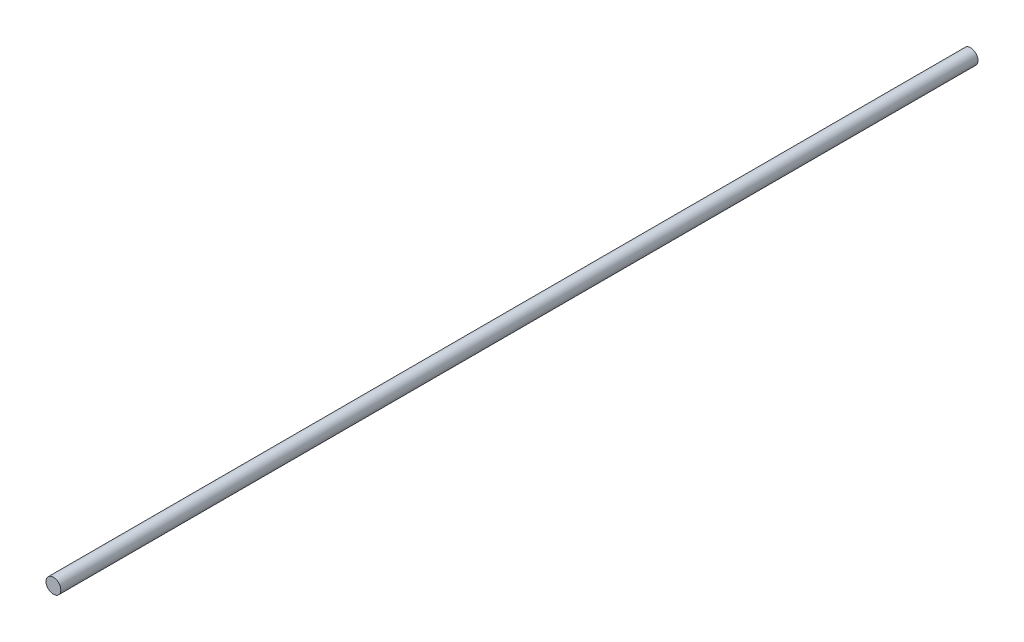
ISO-10303-21;
HEADER;
FILE_DESCRIPTION(('STEP AP214'),'2;1');
FILE_NAME('part.step','',(''),(''),'','','');
FILE_SCHEMA(('AUTOMOTIVE_DESIGN { 1 0 10303 214 1 1 1 1 }'));
ENDSEC;
DATA;
#1=APPLICATION_CONTEXT('core data for automotive mechanical design processes');
#2=APPLICATION_PROTOCOL_DEFINITION('international standard','automotive_design',2000,#1);
#3=PRODUCT_CONTEXT('',#1,'mechanical');
#4=PRODUCT('Part','Part','',(#3));
#5=PRODUCT_RELATED_PRODUCT_CATEGORY('part','',(#4));
#6=PRODUCT_DEFINITION_FORMATION('','',#4);
#7=PRODUCT_DEFINITION_CONTEXT('part definition',#1,'design');
#8=PRODUCT_DEFINITION('design','',#6,#7);
#9=PRODUCT_DEFINITION_SHAPE('','',#8);
#10=(LENGTH_UNIT() NAMED_UNIT(*) SI_UNIT(.MILLI.,.METRE.));
#11=(NAMED_UNIT(*) PLANE_ANGLE_UNIT() SI_UNIT($,.RADIAN.));
#12=(NAMED_UNIT(*) SI_UNIT($,.STERADIAN.) SOLID_ANGLE_UNIT());
#13=UNCERTAINTY_MEASURE_WITH_UNIT(LENGTH_MEASURE(1.E-05),#10,'distance_accuracy_value','');
#14=(GEOMETRIC_REPRESENTATION_CONTEXT(3) GLOBAL_UNCERTAINTY_ASSIGNED_CONTEXT((#13)) GLOBAL_UNIT_ASSIGNED_CONTEXT((#10,
#11,#12)) REPRESENTATION_CONTEXT('',''));
#15=CARTESIAN_POINT('',(0.,0.,0.));
#16=DIRECTION('',(0.,0.,1.));
#17=DIRECTION('',(1.,0.,0.));
#18=AXIS2_PLACEMENT_3D('',#15,#16,#17);
#19=CARTESIAN_POINT('',(0.,0.,310.));
#20=DIRECTION('',(0.,0.,-1.));
#21=DIRECTION('',(-1.,0.,0.));
#22=AXIS2_PLACEMENT_3D('',#19,#20,#21);
#23=CYLINDRICAL_SURFACE('',#22,2.5);
#24=CARTESIAN_POINT('',(0.,0.,310.));
#25=DIRECTION('',(0.,0.,1.));
#26=DIRECTION('',(1.,0.,0.));
#27=AXIS2_PLACEMENT_3D('',#24,#25,#26);
#28=CIRCLE('',#27,2.5);
#29=CARTESIAN_POINT('',(2.5,0.,310.));
#30=VERTEX_POINT('',#29);
#31=EDGE_CURVE('E10',#30,#30,#28,.T.);
#32=ORIENTED_EDGE('',*,*,#31,.F.);
#33=EDGE_LOOP('',(#32));
#34=FACE_BOUND('',#33,.T.);
#35=CARTESIAN_POINT('',(0.,0.,0.));
#36=DIRECTION('',(0.,0.,1.));
#37=DIRECTION('',(1.,0.,0.));
#38=AXIS2_PLACEMENT_3D('',#35,#36,#37);
#39=CIRCLE('',#38,2.5);
#40=CARTESIAN_POINT('',(2.5,0.,0.));
#41=VERTEX_POINT('',#40);
#42=EDGE_CURVE('E42',#41,#41,#39,.T.);
#43=ORIENTED_EDGE('',*,*,#42,.T.);
#44=EDGE_LOOP('',(#43));
#45=FACE_BOUND('',#44,.T.);
#46=ADVANCED_FACE('F39',(#34,#45),#23,.T.);
#47=CARTESIAN_POINT('',(0.,0.,310.));
#48=DIRECTION('',(0.,0.,1.));
#49=DIRECTION('',(1.,0.,0.));
#50=AXIS2_PLACEMENT_3D('',#47,#48,#49);
#51=PLANE('',#50);
#52=ORIENTED_EDGE('',*,*,#31,.T.);
#53=EDGE_LOOP('',(#52));
#54=FACE_BOUND('',#53,.T.);
#55=ADVANCED_FACE('F54',(#54),#51,.T.);
#56=CARTESIAN_POINT('',(0.,0.,0.));
#57=DIRECTION('',(0.,0.,1.));
#58=DIRECTION('',(1.,0.,0.));
#59=AXIS2_PLACEMENT_3D('',#56,#57,#58);
#60=PLANE('',#59);
#61=ORIENTED_EDGE('',*,*,#42,.F.);
#62=EDGE_LOOP('',(#61));
#63=FACE_BOUND('',#62,.T.);
#64=ADVANCED_FACE('F52',(#63),#60,.F.);
#65=CLOSED_SHELL('',(#46,#55,#64));
#66=MANIFOLD_SOLID_BREP('B2',#65);
#67=ADVANCED_BREP_SHAPE_REPRESENTATION('',(#18,#66),#14);
#68=SHAPE_DEFINITION_REPRESENTATION(#9,#67);
ENDSEC;
END-ISO-10303-21;
